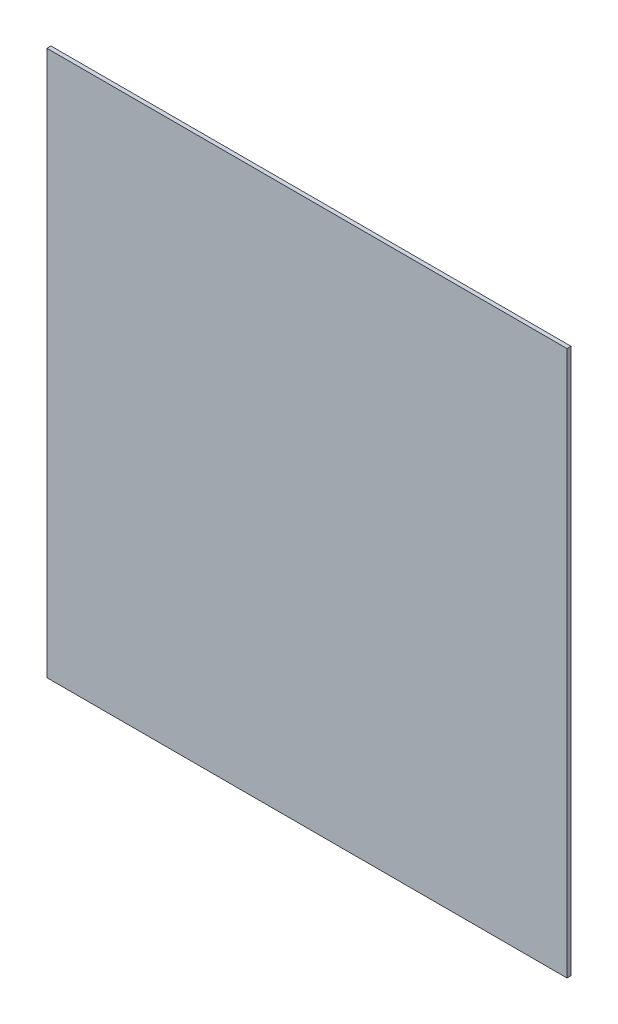
ISO-10303-21;
HEADER;
FILE_DESCRIPTION(('STEP AP214'),'2;1');
FILE_NAME('part.step','',(''),(''),'','','');
FILE_SCHEMA(('AUTOMOTIVE_DESIGN { 1 0 10303 214 1 1 1 1 }'));
ENDSEC;
DATA;
#1=APPLICATION_CONTEXT('core data for automotive mechanical design processes');
#2=APPLICATION_PROTOCOL_DEFINITION('international standard','automotive_design',2000,#1);
#3=PRODUCT_CONTEXT('',#1,'mechanical');
#4=PRODUCT('Part','Part','',(#3));
#5=PRODUCT_RELATED_PRODUCT_CATEGORY('part','',(#4));
#6=PRODUCT_DEFINITION_FORMATION('','',#4);
#7=PRODUCT_DEFINITION_CONTEXT('part definition',#1,'design');
#8=PRODUCT_DEFINITION('design','',#6,#7);
#9=PRODUCT_DEFINITION_SHAPE('','',#8);
#10=(LENGTH_UNIT() NAMED_UNIT(*) SI_UNIT(.MILLI.,.METRE.));
#11=(NAMED_UNIT(*) PLANE_ANGLE_UNIT() SI_UNIT($,.RADIAN.));
#12=(NAMED_UNIT(*) SI_UNIT($,.STERADIAN.) SOLID_ANGLE_UNIT());
#13=UNCERTAINTY_MEASURE_WITH_UNIT(LENGTH_MEASURE(1.E-05),#10,'distance_accuracy_value','');
#14=(GEOMETRIC_REPRESENTATION_CONTEXT(3) GLOBAL_UNCERTAINTY_ASSIGNED_CONTEXT((#13)) GLOBAL_UNIT_ASSIGNED_CONTEXT((#10,
#11,#12)) REPRESENTATION_CONTEXT('',''));
#15=CARTESIAN_POINT('',(0.,0.,0.));
#16=DIRECTION('',(0.,0.,1.));
#17=DIRECTION('',(1.,0.,0.));
#18=AXIS2_PLACEMENT_3D('',#15,#16,#17);
#19=CARTESIAN_POINT('',(-65.4525,-92.916604699861,0.127));
#20=DIRECTION('',(-1.,0.,0.));
#21=DIRECTION('',(0.,0.,1.));
#22=AXIS2_PLACEMENT_3D('',#19,#20,#21);
#23=PLANE('',#22);
#24=DIRECTION('',(0.,1.,0.));
#25=VECTOR('',#24,1.);
#26=CARTESIAN_POINT('',(-65.4525,-92.916604699861,0.));
#27=LINE('',#26,#25);
#28=CARTESIAN_POINT('',(-65.4525,-92.916604699861,0.));
#29=VERTEX_POINT('',#28);
#30=CARTESIAN_POINT('',(-65.4525,-75.7078546998609,0.));
#31=VERTEX_POINT('',#30);
#32=EDGE_CURVE('E96',#29,#31,#27,.T.);
#33=ORIENTED_EDGE('',*,*,#32,.T.);
#34=DIRECTION('',(0.,0.,-1.));
#35=VECTOR('',#34,1.);
#36=CARTESIAN_POINT('',(-65.4525,-75.7078546998609,0.127));
#37=LINE('',#36,#35);
#38=CARTESIAN_POINT('',(-65.4525,-75.7078546998609,0.127));
#39=VERTEX_POINT('',#38);
#40=EDGE_CURVE('E11',#39,#31,#37,.T.);
#41=ORIENTED_EDGE('',*,*,#40,.F.);
#42=DIRECTION('',(0.,1.,0.));
#43=VECTOR('',#42,1.);
#44=CARTESIAN_POINT('',(-65.4525,-92.916604699861,0.127));
#45=LINE('',#44,#43);
#46=CARTESIAN_POINT('',(-65.4525,-92.916604699861,0.127));
#47=VERTEX_POINT('',#46);
#48=EDGE_CURVE('E84',#47,#39,#45,.T.);
#49=ORIENTED_EDGE('',*,*,#48,.F.);
#50=DIRECTION('',(0.,0.,-1.));
#51=VECTOR('',#50,1.);
#52=CARTESIAN_POINT('',(-65.4525,-92.916604699861,0.127));
#53=LINE('',#52,#51);
#54=EDGE_CURVE('E92',#47,#29,#53,.T.);
#55=ORIENTED_EDGE('',*,*,#54,.T.);
#56=EDGE_LOOP('',(#33,#41,#49,#55));
#57=FACE_BOUND('',#56,.T.);
#58=ADVANCED_FACE('F33',(#57),#23,.F.);
#59=CARTESIAN_POINT('',(-65.4525,-75.7078546998609,0.127));
#60=DIRECTION('',(0.,-1.,0.));
#61=DIRECTION('',(0.,0.,-1.));
#62=AXIS2_PLACEMENT_3D('',#59,#60,#61);
#63=PLANE('',#62);
#64=DIRECTION('',(-1.,0.,0.));
#65=VECTOR('',#64,1.);
#66=CARTESIAN_POINT('',(-65.4525,-75.7078546998609,0.));
#67=LINE('',#66,#65);
#68=CARTESIAN_POINT('',(-81.8675,-75.7078546998609,0.));
#69=VERTEX_POINT('',#68);
#70=EDGE_CURVE('E88',#31,#69,#67,.T.);
#71=ORIENTED_EDGE('',*,*,#70,.T.);
#72=DIRECTION('',(0.,0.,-1.));
#73=VECTOR('',#72,1.);
#74=CARTESIAN_POINT('',(-81.8675,-75.7078546998609,0.127));
#75=LINE('',#74,#73);
#76=CARTESIAN_POINT('',(-81.8675,-75.7078546998609,0.127));
#77=VERTEX_POINT('',#76);
#78=EDGE_CURVE('E41',#77,#69,#75,.T.);
#79=ORIENTED_EDGE('',*,*,#78,.F.);
#80=DIRECTION('',(-1.,0.,0.));
#81=VECTOR('',#80,1.);
#82=CARTESIAN_POINT('',(-65.4525,-75.7078546998609,0.127));
#83=LINE('',#82,#81);
#84=EDGE_CURVE('E79',#39,#77,#83,.T.);
#85=ORIENTED_EDGE('',*,*,#84,.F.);
#86=ORIENTED_EDGE('',*,*,#40,.T.);
#87=EDGE_LOOP('',(#71,#79,#85,#86));
#88=FACE_BOUND('',#87,.T.);
#89=ADVANCED_FACE('F87',(#88),#63,.F.);
#90=CARTESIAN_POINT('',(-81.8675,-92.916604699861,0.127));
#91=DIRECTION('',(1.,0.,0.));
#92=DIRECTION('',(0.,0.,-1.));
#93=AXIS2_PLACEMENT_3D('',#90,#91,#92);
#94=PLANE('',#93);
#95=DIRECTION('',(0.,-1.,0.));
#96=VECTOR('',#95,1.);
#97=CARTESIAN_POINT('',(-81.8675,-92.916604699861,0.));
#98=LINE('',#97,#96);
#99=CARTESIAN_POINT('',(-81.8675,-92.916604699861,0.));
#100=VERTEX_POINT('',#99);
#101=EDGE_CURVE('E66',#69,#100,#98,.T.);
#102=ORIENTED_EDGE('',*,*,#101,.T.);
#103=DIRECTION('',(0.,0.,-1.));
#104=VECTOR('',#103,1.);
#105=CARTESIAN_POINT('',(-81.8675,-92.916604699861,0.127));
#106=LINE('',#105,#104);
#107=CARTESIAN_POINT('',(-81.8675,-92.916604699861,0.127));
#108=VERTEX_POINT('',#107);
#109=EDGE_CURVE('E89',#108,#100,#106,.T.);
#110=ORIENTED_EDGE('',*,*,#109,.F.);
#111=DIRECTION('',(0.,-1.,0.));
#112=VECTOR('',#111,1.);
#113=CARTESIAN_POINT('',(-81.8675,-92.916604699861,0.127));
#114=LINE('',#113,#112);
#115=EDGE_CURVE('E82',#77,#108,#114,.T.);
#116=ORIENTED_EDGE('',*,*,#115,.F.);
#117=ORIENTED_EDGE('',*,*,#78,.T.);
#118=EDGE_LOOP('',(#102,#110,#116,#117));
#119=FACE_BOUND('',#118,.T.);
#120=ADVANCED_FACE('F90',(#119),#94,.F.);
#121=CARTESIAN_POINT('',(-65.4525,-92.916604699861,0.127));
#122=DIRECTION('',(0.,1.,0.));
#123=DIRECTION('',(0.,0.,1.));
#124=AXIS2_PLACEMENT_3D('',#121,#122,#123);
#125=PLANE('',#124);
#126=DIRECTION('',(1.,0.,0.));
#127=VECTOR('',#126,1.);
#128=CARTESIAN_POINT('',(-65.4525,-92.916604699861,0.));
#129=LINE('',#128,#127);
#130=EDGE_CURVE('E72',#100,#29,#129,.T.);
#131=ORIENTED_EDGE('',*,*,#130,.T.);
#132=ORIENTED_EDGE('',*,*,#54,.F.);
#133=DIRECTION('',(1.,0.,0.));
#134=VECTOR('',#133,1.);
#135=CARTESIAN_POINT('',(-65.4525,-92.916604699861,0.127));
#136=LINE('',#135,#134);
#137=EDGE_CURVE('E49',#108,#47,#136,.T.);
#138=ORIENTED_EDGE('',*,*,#137,.F.);
#139=ORIENTED_EDGE('',*,*,#109,.T.);
#140=EDGE_LOOP('',(#131,#132,#138,#139));
#141=FACE_BOUND('',#140,.T.);
#142=ADVANCED_FACE('F103',(#141),#125,.F.);
#143=CARTESIAN_POINT('',(0.,0.,0.127));
#144=DIRECTION('',(0.,0.,1.));
#145=DIRECTION('',(1.,0.,0.));
#146=AXIS2_PLACEMENT_3D('',#143,#144,#145);
#147=PLANE('',#146);
#148=ORIENTED_EDGE('',*,*,#48,.T.);
#149=ORIENTED_EDGE('',*,*,#84,.T.);
#150=ORIENTED_EDGE('',*,*,#115,.T.);
#151=ORIENTED_EDGE('',*,*,#137,.T.);
#152=EDGE_LOOP('',(#148,#149,#150,#151));
#153=FACE_BOUND('',#152,.T.);
#154=ADVANCED_FACE('F80',(#153),#147,.T.);
#155=CARTESIAN_POINT('',(0.,0.,0.));
#156=DIRECTION('',(0.,0.,1.));
#157=DIRECTION('',(1.,0.,0.));
#158=AXIS2_PLACEMENT_3D('',#155,#156,#157);
#159=PLANE('',#158);
#160=ORIENTED_EDGE('',*,*,#32,.F.);
#161=ORIENTED_EDGE('',*,*,#130,.F.);
#162=ORIENTED_EDGE('',*,*,#101,.F.);
#163=ORIENTED_EDGE('',*,*,#70,.F.);
#164=EDGE_LOOP('',(#160,#161,#162,#163));
#165=FACE_BOUND('',#164,.T.);
#166=ADVANCED_FACE('F106',(#165),#159,.F.);
#167=CLOSED_SHELL('',(#58,#89,#120,#142,#154,#166));
#168=MANIFOLD_SOLID_BREP('B2',#167);
#169=ADVANCED_BREP_SHAPE_REPRESENTATION('',(#18,#168),#14);
#170=SHAPE_DEFINITION_REPRESENTATION(#9,#169);
ENDSEC;
END-ISO-10303-21;
